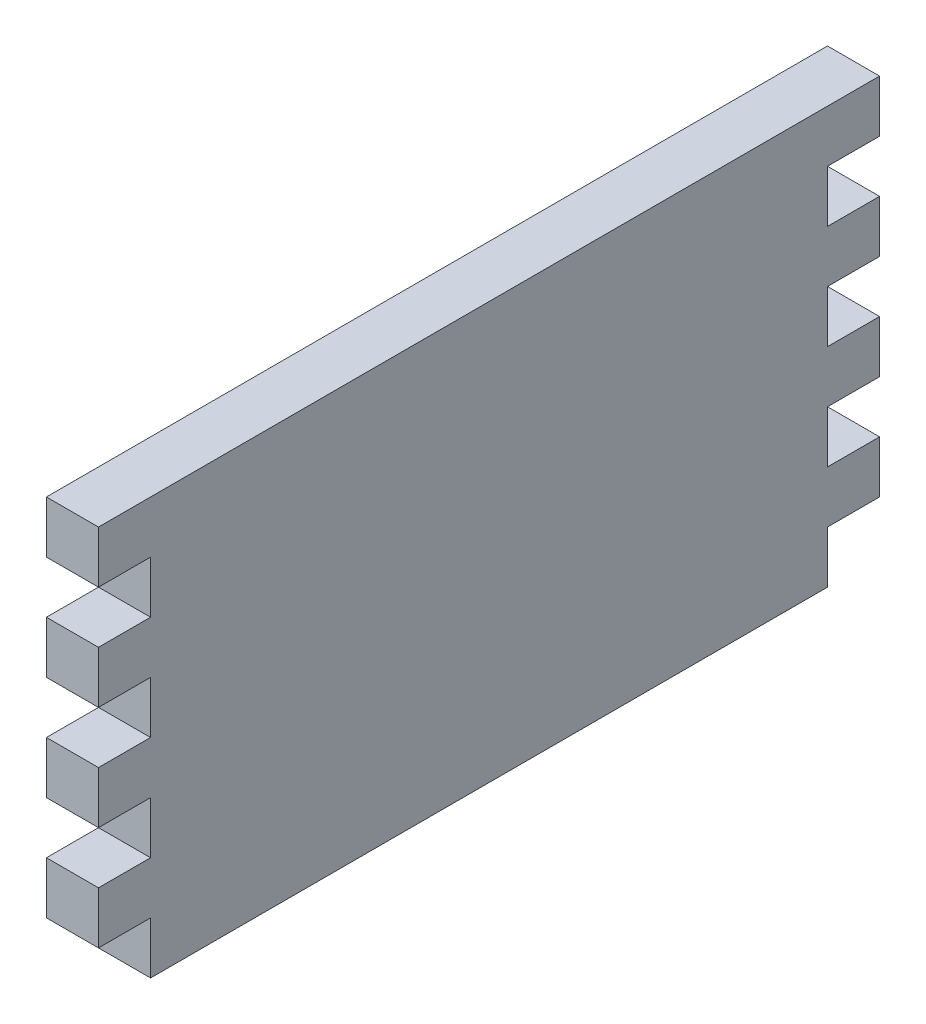
ISO-10303-21;
HEADER;
FILE_DESCRIPTION(('STEP AP214'),'2;1');
FILE_NAME('part.step','',(''),(''),'','','');
FILE_SCHEMA(('AUTOMOTIVE_DESIGN { 1 0 10303 214 1 1 1 1 }'));
ENDSEC;
DATA;
#1=APPLICATION_CONTEXT('core data for automotive mechanical design processes');
#2=APPLICATION_PROTOCOL_DEFINITION('international standard','automotive_design',2000,#1);
#3=PRODUCT_CONTEXT('',#1,'mechanical');
#4=PRODUCT('Part','Part','',(#3));
#5=PRODUCT_RELATED_PRODUCT_CATEGORY('part','',(#4));
#6=PRODUCT_DEFINITION_FORMATION('','',#4);
#7=PRODUCT_DEFINITION_CONTEXT('part definition',#1,'design');
#8=PRODUCT_DEFINITION('design','',#6,#7);
#9=PRODUCT_DEFINITION_SHAPE('','',#8);
#10=(LENGTH_UNIT() NAMED_UNIT(*) SI_UNIT(.MILLI.,.METRE.));
#11=(NAMED_UNIT(*) PLANE_ANGLE_UNIT() SI_UNIT($,.RADIAN.));
#12=(NAMED_UNIT(*) SI_UNIT($,.STERADIAN.) SOLID_ANGLE_UNIT());
#13=UNCERTAINTY_MEASURE_WITH_UNIT(LENGTH_MEASURE(1.E-05),#10,'distance_accuracy_value','');
#14=(GEOMETRIC_REPRESENTATION_CONTEXT(3) GLOBAL_UNCERTAINTY_ASSIGNED_CONTEXT((#13)) GLOBAL_UNIT_ASSIGNED_CONTEXT((#10,
#11,#12)) REPRESENTATION_CONTEXT('',''));
#15=CARTESIAN_POINT('',(0.,0.,0.));
#16=DIRECTION('',(0.,0.,1.));
#17=DIRECTION('',(1.,0.,0.));
#18=AXIS2_PLACEMENT_3D('',#15,#16,#17);
#19=CARTESIAN_POINT('',(10.,0.,150.));
#20=DIRECTION('',(0.,0.,-1.));
#21=DIRECTION('',(-1.,0.,0.));
#22=AXIS2_PLACEMENT_3D('',#19,#20,#21);
#23=PLANE('',#22);
#24=DIRECTION('',(0.,-1.,0.));
#25=VECTOR('',#24,1.);
#26=CARTESIAN_POINT('',(0.,0.,150.));
#27=LINE('',#26,#25);
#28=CARTESIAN_POINT('',(0.,20.,150.));
#29=VERTEX_POINT('',#28);
#30=CARTESIAN_POINT('',(0.,10.,150.));
#31=VERTEX_POINT('',#30);
#32=EDGE_CURVE('E259',#29,#31,#27,.T.);
#33=ORIENTED_EDGE('',*,*,#32,.T.);
#34=DIRECTION('',(-1.,0.,0.));
#35=VECTOR('',#34,1.);
#36=CARTESIAN_POINT('',(10.,10.,150.));
#37=LINE('',#36,#35);
#38=CARTESIAN_POINT('',(10.,10.,150.));
#39=VERTEX_POINT('',#38);
#40=EDGE_CURVE('E48',#39,#31,#37,.T.);
#41=ORIENTED_EDGE('',*,*,#40,.F.);
#42=DIRECTION('',(0.,-1.,0.));
#43=VECTOR('',#42,1.);
#44=CARTESIAN_POINT('',(10.,0.,150.));
#45=LINE('',#44,#43);
#46=CARTESIAN_POINT('',(10.,20.,150.));
#47=VERTEX_POINT('',#46);
#48=EDGE_CURVE('E257',#47,#39,#45,.T.);
#49=ORIENTED_EDGE('',*,*,#48,.F.);
#50=DIRECTION('',(-1.,0.,0.));
#51=VECTOR('',#50,1.);
#52=CARTESIAN_POINT('',(10.,20.,150.));
#53=LINE('',#52,#51);
#54=EDGE_CURVE('E532',#47,#29,#53,.T.);
#55=ORIENTED_EDGE('',*,*,#54,.T.);
#56=EDGE_LOOP('',(#33,#41,#49,#55));
#57=FACE_BOUND('',#56,.T.);
#58=ADVANCED_FACE('F33',(#57),#23,.F.);
#59=CARTESIAN_POINT('',(10.,0.,0.));
#60=DIRECTION('',(0.,0.,1.));
#61=DIRECTION('',(1.,0.,0.));
#62=AXIS2_PLACEMENT_3D('',#59,#60,#61);
#63=PLANE('',#62);
#64=DIRECTION('',(0.,1.,0.));
#65=VECTOR('',#64,1.);
#66=CARTESIAN_POINT('',(10.,0.,0.));
#67=LINE('',#66,#65);
#68=CARTESIAN_POINT('',(10.,30.,0.));
#69=VERTEX_POINT('',#68);
#70=CARTESIAN_POINT('',(10.,40.,0.));
#71=VERTEX_POINT('',#70);
#72=EDGE_CURVE('E386',#69,#71,#67,.T.);
#73=ORIENTED_EDGE('',*,*,#72,.F.);
#74=DIRECTION('',(-1.,0.,0.));
#75=VECTOR('',#74,1.);
#76=CARTESIAN_POINT('',(10.,30.,0.));
#77=LINE('',#76,#75);
#78=CARTESIAN_POINT('',(0.,30.,0.));
#79=VERTEX_POINT('',#78);
#80=EDGE_CURVE('E474',#69,#79,#77,.T.);
#81=ORIENTED_EDGE('',*,*,#80,.T.);
#82=DIRECTION('',(0.,1.,0.));
#83=VECTOR('',#82,1.);
#84=CARTESIAN_POINT('',(0.,0.,0.));
#85=LINE('',#84,#83);
#86=CARTESIAN_POINT('',(0.,40.,0.));
#87=VERTEX_POINT('',#86);
#88=EDGE_CURVE('E431',#79,#87,#85,.T.);
#89=ORIENTED_EDGE('',*,*,#88,.T.);
#90=DIRECTION('',(-1.,0.,0.));
#91=VECTOR('',#90,1.);
#92=CARTESIAN_POINT('',(10.,40.,0.));
#93=LINE('',#92,#91);
#94=EDGE_CURVE('E320',#71,#87,#93,.T.);
#95=ORIENTED_EDGE('',*,*,#94,.F.);
#96=EDGE_LOOP('',(#73,#81,#89,#95));
#97=FACE_BOUND('',#96,.T.);
#98=ADVANCED_FACE('F472',(#97),#63,.F.);
#99=CARTESIAN_POINT('',(0.,40.,150.));
#100=VERTEX_POINT('',#99);
#101=CARTESIAN_POINT('',(0.,30.,150.));
#102=VERTEX_POINT('',#101);
#103=EDGE_CURVE('E424',#100,#102,#27,.T.);
#104=ORIENTED_EDGE('',*,*,#103,.T.);
#105=DIRECTION('',(-1.,0.,0.));
#106=VECTOR('',#105,1.);
#107=CARTESIAN_POINT('',(10.,30.,150.));
#108=LINE('',#107,#106);
#109=CARTESIAN_POINT('',(10.,30.,150.));
#110=VERTEX_POINT('',#109);
#111=EDGE_CURVE('E538',#110,#102,#108,.T.);
#112=ORIENTED_EDGE('',*,*,#111,.F.);
#113=CARTESIAN_POINT('',(10.,40.,150.));
#114=VERTEX_POINT('',#113);
#115=EDGE_CURVE('E266',#114,#110,#45,.T.);
#116=ORIENTED_EDGE('',*,*,#115,.F.);
#117=DIRECTION('',(-1.,0.,0.));
#118=VECTOR('',#117,1.);
#119=CARTESIAN_POINT('',(10.,40.,150.));
#120=LINE('',#119,#118);
#121=EDGE_CURVE('E325',#114,#100,#120,.T.);
#122=ORIENTED_EDGE('',*,*,#121,.T.);
#123=EDGE_LOOP('',(#104,#112,#116,#122));
#124=FACE_BOUND('',#123,.T.);
#125=ADVANCED_FACE('F597',(#124),#23,.F.);
#126=CARTESIAN_POINT('',(10.,50.,0.));
#127=VERTEX_POINT('',#126);
#128=CARTESIAN_POINT('',(10.,60.,0.));
#129=VERTEX_POINT('',#128);
#130=EDGE_CURVE('E392',#127,#129,#67,.T.);
#131=ORIENTED_EDGE('',*,*,#130,.F.);
#132=DIRECTION('',(-1.,0.,0.));
#133=VECTOR('',#132,1.);
#134=CARTESIAN_POINT('',(10.,50.,0.));
#135=LINE('',#134,#133);
#136=CARTESIAN_POINT('',(0.,50.,0.));
#137=VERTEX_POINT('',#136);
#138=EDGE_CURVE('E329',#127,#137,#135,.T.);
#139=ORIENTED_EDGE('',*,*,#138,.T.);
#140=CARTESIAN_POINT('',(0.,60.,0.));
#141=VERTEX_POINT('',#140);
#142=EDGE_CURVE('E438',#137,#141,#85,.T.);
#143=ORIENTED_EDGE('',*,*,#142,.T.);
#144=DIRECTION('',(-1.,0.,0.));
#145=VECTOR('',#144,1.);
#146=CARTESIAN_POINT('',(10.,60.,0.));
#147=LINE('',#146,#145);
#148=EDGE_CURVE('E369',#129,#141,#147,.T.);
#149=ORIENTED_EDGE('',*,*,#148,.F.);
#150=EDGE_LOOP('',(#131,#139,#143,#149));
#151=FACE_BOUND('',#150,.T.);
#152=ADVANCED_FACE('F445',(#151),#63,.F.);
#153=CARTESIAN_POINT('',(0.,60.,150.));
#154=VERTEX_POINT('',#153);
#155=CARTESIAN_POINT('',(0.,50.,150.));
#156=VERTEX_POINT('',#155);
#157=EDGE_CURVE('E296',#154,#156,#27,.T.);
#158=ORIENTED_EDGE('',*,*,#157,.T.);
#159=DIRECTION('',(-1.,0.,0.));
#160=VECTOR('',#159,1.);
#161=CARTESIAN_POINT('',(10.,50.,150.));
#162=LINE('',#161,#160);
#163=CARTESIAN_POINT('',(10.,50.,150.));
#164=VERTEX_POINT('',#163);
#165=EDGE_CURVE('E295',#164,#156,#162,.T.);
#166=ORIENTED_EDGE('',*,*,#165,.F.);
#167=CARTESIAN_POINT('',(10.,60.,150.));
#168=VERTEX_POINT('',#167);
#169=EDGE_CURVE('E271',#168,#164,#45,.T.);
#170=ORIENTED_EDGE('',*,*,#169,.F.);
#171=DIRECTION('',(-1.,0.,0.));
#172=VECTOR('',#171,1.);
#173=CARTESIAN_POINT('',(10.,60.,150.));
#174=LINE('',#173,#172);
#175=EDGE_CURVE('E293',#168,#154,#174,.T.);
#176=ORIENTED_EDGE('',*,*,#175,.T.);
#177=EDGE_LOOP('',(#158,#166,#170,#176));
#178=FACE_BOUND('',#177,.T.);
#179=ADVANCED_FACE('F292',(#178),#23,.F.);
#180=CARTESIAN_POINT('',(10.,70.,0.));
#181=VERTEX_POINT('',#180);
#182=CARTESIAN_POINT('',(10.,80.,0.));
#183=VERTEX_POINT('',#182);
#184=EDGE_CURVE('E387',#181,#183,#67,.T.);
#185=ORIENTED_EDGE('',*,*,#184,.F.);
#186=DIRECTION('',(-1.,0.,0.));
#187=VECTOR('',#186,1.);
#188=CARTESIAN_POINT('',(10.,70.,0.));
#189=LINE('',#188,#187);
#190=CARTESIAN_POINT('',(0.,70.,0.));
#191=VERTEX_POINT('',#190);
#192=EDGE_CURVE('E376',#181,#191,#189,.T.);
#193=ORIENTED_EDGE('',*,*,#192,.T.);
#194=CARTESIAN_POINT('',(0.,80.,0.));
#195=VERTEX_POINT('',#194);
#196=EDGE_CURVE('E379',#191,#195,#85,.T.);
#197=ORIENTED_EDGE('',*,*,#196,.T.);
#198=DIRECTION('',(-1.,0.,0.));
#199=VECTOR('',#198,1.);
#200=CARTESIAN_POINT('',(10.,80.,0.));
#201=LINE('',#200,#199);
#202=EDGE_CURVE('E11',#183,#195,#201,.T.);
#203=ORIENTED_EDGE('',*,*,#202,.F.);
#204=EDGE_LOOP('',(#185,#193,#197,#203));
#205=FACE_BOUND('',#204,.T.);
#206=ADVANCED_FACE('F611',(#205),#63,.F.);
#207=CARTESIAN_POINT('',(10.,10.,0.));
#208=VERTEX_POINT('',#207);
#209=CARTESIAN_POINT('',(10.,20.,0.));
#210=VERTEX_POINT('',#209);
#211=EDGE_CURVE('E272',#208,#210,#67,.T.);
#212=ORIENTED_EDGE('',*,*,#211,.F.);
#213=DIRECTION('',(-1.,0.,0.));
#214=VECTOR('',#213,1.);
#215=CARTESIAN_POINT('',(10.,10.,0.));
#216=LINE('',#215,#214);
#217=CARTESIAN_POINT('',(0.,10.,0.));
#218=VERTEX_POINT('',#217);
#219=EDGE_CURVE('E521',#208,#218,#216,.T.);
#220=ORIENTED_EDGE('',*,*,#219,.T.);
#221=CARTESIAN_POINT('',(0.,20.,0.));
#222=VERTEX_POINT('',#221);
#223=EDGE_CURVE('E430',#218,#222,#85,.T.);
#224=ORIENTED_EDGE('',*,*,#223,.T.);
#225=DIRECTION('',(-1.,0.,0.));
#226=VECTOR('',#225,1.);
#227=CARTESIAN_POINT('',(10.,20.,0.));
#228=LINE('',#227,#226);
#229=EDGE_CURVE('E495',#210,#222,#228,.T.);
#230=ORIENTED_EDGE('',*,*,#229,.F.);
#231=EDGE_LOOP('',(#212,#220,#224,#230));
#232=FACE_BOUND('',#231,.T.);
#233=ADVANCED_FACE('F35',(#232),#63,.F.);
#234=CARTESIAN_POINT('',(10.,80.,0.));
#235=DIRECTION('',(0.,-1.,0.));
#236=DIRECTION('',(0.,0.,-1.));
#237=AXIS2_PLACEMENT_3D('',#234,#235,#236);
#238=PLANE('',#237);
#239=DIRECTION('',(0.,0.,1.));
#240=VECTOR('',#239,1.);
#241=CARTESIAN_POINT('',(0.,80.,0.));
#242=LINE('',#241,#240);
#243=CARTESIAN_POINT('',(0.,80.,150.));
#244=VERTEX_POINT('',#243);
#245=EDGE_CURVE('E412',#195,#244,#242,.T.);
#246=ORIENTED_EDGE('',*,*,#245,.T.);
#247=DIRECTION('',(-1.,0.,0.));
#248=VECTOR('',#247,1.);
#249=CARTESIAN_POINT('',(10.,80.,150.));
#250=LINE('',#249,#248);
#251=CARTESIAN_POINT('',(10.,80.,150.));
#252=VERTEX_POINT('',#251);
#253=EDGE_CURVE('E41',#252,#244,#250,.T.);
#254=ORIENTED_EDGE('',*,*,#253,.F.);
#255=DIRECTION('',(0.,0.,1.));
#256=VECTOR('',#255,1.);
#257=CARTESIAN_POINT('',(10.,80.,0.));
#258=LINE('',#257,#256);
#259=EDGE_CURVE('E267',#183,#252,#258,.T.);
#260=ORIENTED_EDGE('',*,*,#259,.F.);
#261=ORIENTED_EDGE('',*,*,#202,.T.);
#262=EDGE_LOOP('',(#246,#254,#260,#261));
#263=FACE_BOUND('',#262,.T.);
#264=ADVANCED_FACE('F605',(#263),#238,.F.);
#265=CARTESIAN_POINT('',(0.,70.,150.));
#266=VERTEX_POINT('',#265);
#267=EDGE_CURVE('E395',#244,#266,#27,.T.);
#268=ORIENTED_EDGE('',*,*,#267,.T.);
#269=DIRECTION('',(-1.,0.,0.));
#270=VECTOR('',#269,1.);
#271=CARTESIAN_POINT('',(10.,70.,150.));
#272=LINE('',#271,#270);
#273=CARTESIAN_POINT('',(10.,70.,150.));
#274=VERTEX_POINT('',#273);
#275=EDGE_CURVE('E345',#274,#266,#272,.T.);
#276=ORIENTED_EDGE('',*,*,#275,.F.);
#277=EDGE_CURVE('E269',#252,#274,#45,.T.);
#278=ORIENTED_EDGE('',*,*,#277,.F.);
#279=ORIENTED_EDGE('',*,*,#253,.T.);
#280=EDGE_LOOP('',(#268,#276,#278,#279));
#281=FACE_BOUND('',#280,.T.);
#282=ADVANCED_FACE('F404',(#281),#23,.F.);
#283=CARTESIAN_POINT('',(10.,0.,0.));
#284=DIRECTION('',(0.,1.,0.));
#285=DIRECTION('',(0.,0.,1.));
#286=AXIS2_PLACEMENT_3D('',#283,#284,#285);
#287=PLANE('',#286);
#288=DIRECTION('',(0.,0.,-1.));
#289=VECTOR('',#288,1.);
#290=CARTESIAN_POINT('',(10.,0.,0.));
#291=LINE('',#290,#289);
#292=CARTESIAN_POINT('',(10.,0.,140.));
#293=VERTEX_POINT('',#292);
#294=CARTESIAN_POINT('',(10.,0.,10.));
#295=VERTEX_POINT('',#294);
#296=EDGE_CURVE('E276',#293,#295,#291,.T.);
#297=ORIENTED_EDGE('',*,*,#296,.F.);
#298=DIRECTION('',(-1.,0.,0.));
#299=VECTOR('',#298,1.);
#300=CARTESIAN_POINT('',(10.,0.,140.));
#301=LINE('',#300,#299);
#302=CARTESIAN_POINT('',(0.,0.,140.));
#303=VERTEX_POINT('',#302);
#304=EDGE_CURVE('E558',#293,#303,#301,.T.);
#305=ORIENTED_EDGE('',*,*,#304,.T.);
#306=DIRECTION('',(0.,0.,-1.));
#307=VECTOR('',#306,1.);
#308=CARTESIAN_POINT('',(0.,0.,0.));
#309=LINE('',#308,#307);
#310=CARTESIAN_POINT('',(0.,0.,10.));
#311=VERTEX_POINT('',#310);
#312=EDGE_CURVE('E56',#303,#311,#309,.T.);
#313=ORIENTED_EDGE('',*,*,#312,.T.);
#314=DIRECTION('',(-1.,0.,0.));
#315=VECTOR('',#314,1.);
#316=CARTESIAN_POINT('',(10.,0.,10.));
#317=LINE('',#316,#315);
#318=EDGE_CURVE('E563',#295,#311,#317,.T.);
#319=ORIENTED_EDGE('',*,*,#318,.F.);
#320=EDGE_LOOP('',(#297,#305,#313,#319));
#321=FACE_BOUND('',#320,.T.);
#322=ADVANCED_FACE('F604',(#321),#287,.F.);
#323=CARTESIAN_POINT('',(10.,0.,0.));
#324=DIRECTION('',(1.,0.,0.));
#325=DIRECTION('',(0.,0.,-1.));
#326=AXIS2_PLACEMENT_3D('',#323,#324,#325);
#327=PLANE('',#326);
#328=DIRECTION('',(0.,-1.,0.));
#329=VECTOR('',#328,1.);
#330=CARTESIAN_POINT('',(10.,10.,140.));
#331=LINE('',#330,#329);
#332=CARTESIAN_POINT('',(10.,10.,140.));
#333=VERTEX_POINT('',#332);
#334=EDGE_CURVE('E250',#333,#293,#331,.T.);
#335=ORIENTED_EDGE('',*,*,#334,.T.);
#336=ORIENTED_EDGE('',*,*,#296,.T.);
#337=DIRECTION('',(0.,1.,0.));
#338=VECTOR('',#337,1.);
#339=CARTESIAN_POINT('',(10.,9.99999999999999,10.));
#340=LINE('',#339,#338);
#341=CARTESIAN_POINT('',(10.,9.99999999999999,10.));
#342=VERTEX_POINT('',#341);
#343=EDGE_CURVE('E553',#295,#342,#340,.T.);
#344=ORIENTED_EDGE('',*,*,#343,.T.);
#345=DIRECTION('',(0.,0.,-1.));
#346=VECTOR('',#345,1.);
#347=CARTESIAN_POINT('',(10.,10.,0.));
#348=LINE('',#347,#346);
#349=EDGE_CURVE('E556',#342,#208,#348,.T.);
#350=ORIENTED_EDGE('',*,*,#349,.T.);
#351=ORIENTED_EDGE('',*,*,#211,.T.);
#352=DIRECTION('',(0.,0.,1.));
#353=VECTOR('',#352,1.);
#354=CARTESIAN_POINT('',(10.,20.,0.));
#355=LINE('',#354,#353);
#356=CARTESIAN_POINT('',(10.,20.,10.));
#357=VERTEX_POINT('',#356);
#358=EDGE_CURVE('E482',#210,#357,#355,.T.);
#359=ORIENTED_EDGE('',*,*,#358,.T.);
#360=DIRECTION('',(0.,1.,0.));
#361=VECTOR('',#360,1.);
#362=CARTESIAN_POINT('',(10.,30.,10.));
#363=LINE('',#362,#361);
#364=CARTESIAN_POINT('',(10.,30.,10.));
#365=VERTEX_POINT('',#364);
#366=EDGE_CURVE('E484',#357,#365,#363,.T.);
#367=ORIENTED_EDGE('',*,*,#366,.T.);
#368=DIRECTION('',(0.,0.,-1.));
#369=VECTOR('',#368,1.);
#370=CARTESIAN_POINT('',(10.,30.,0.));
#371=LINE('',#370,#369);
#372=EDGE_CURVE('E497',#365,#69,#371,.T.);
#373=ORIENTED_EDGE('',*,*,#372,.T.);
#374=ORIENTED_EDGE('',*,*,#72,.T.);
#375=DIRECTION('',(0.,0.,1.));
#376=VECTOR('',#375,1.);
#377=CARTESIAN_POINT('',(10.,40.,0.));
#378=LINE('',#377,#376);
#379=CARTESIAN_POINT('',(10.,40.,10.));
#380=VERTEX_POINT('',#379);
#381=EDGE_CURVE('E310',#71,#380,#378,.T.);
#382=ORIENTED_EDGE('',*,*,#381,.T.);
#383=DIRECTION('',(0.,1.,0.));
#384=VECTOR('',#383,1.);
#385=CARTESIAN_POINT('',(10.,50.,10.));
#386=LINE('',#385,#384);
#387=CARTESIAN_POINT('',(10.,50.,10.));
#388=VERTEX_POINT('',#387);
#389=EDGE_CURVE('E313',#380,#388,#386,.T.);
#390=ORIENTED_EDGE('',*,*,#389,.T.);
#391=DIRECTION('',(0.,0.,-1.));
#392=VECTOR('',#391,1.);
#393=CARTESIAN_POINT('',(10.,50.,0.));
#394=LINE('',#393,#392);
#395=EDGE_CURVE('E317',#388,#127,#394,.T.);
#396=ORIENTED_EDGE('',*,*,#395,.T.);
#397=ORIENTED_EDGE('',*,*,#130,.T.);
#398=DIRECTION('',(0.,0.,1.));
#399=VECTOR('',#398,1.);
#400=CARTESIAN_POINT('',(10.,60.,0.));
#401=LINE('',#400,#399);
#402=CARTESIAN_POINT('',(10.,60.,10.));
#403=VERTEX_POINT('',#402);
#404=EDGE_CURVE('E359',#129,#403,#401,.T.);
#405=ORIENTED_EDGE('',*,*,#404,.T.);
#406=DIRECTION('',(0.,1.,0.));
#407=VECTOR('',#406,1.);
#408=CARTESIAN_POINT('',(10.,70.,10.));
#409=LINE('',#408,#407);
#410=CARTESIAN_POINT('',(10.,70.,10.));
#411=VERTEX_POINT('',#410);
#412=EDGE_CURVE('E362',#403,#411,#409,.T.);
#413=ORIENTED_EDGE('',*,*,#412,.T.);
#414=DIRECTION('',(0.,0.,-1.));
#415=VECTOR('',#414,1.);
#416=CARTESIAN_POINT('',(10.,70.,0.));
#417=LINE('',#416,#415);
#418=EDGE_CURVE('E366',#411,#181,#417,.T.);
#419=ORIENTED_EDGE('',*,*,#418,.T.);
#420=ORIENTED_EDGE('',*,*,#184,.T.);
#421=ORIENTED_EDGE('',*,*,#259,.T.);
#422=ORIENTED_EDGE('',*,*,#277,.T.);
#423=DIRECTION('',(0.,0.,-1.));
#424=VECTOR('',#423,1.);
#425=CARTESIAN_POINT('',(10.,70.,150.));
#426=LINE('',#425,#424);
#427=CARTESIAN_POINT('',(10.,70.,140.));
#428=VERTEX_POINT('',#427);
#429=EDGE_CURVE('E339',#274,#428,#426,.T.);
#430=ORIENTED_EDGE('',*,*,#429,.T.);
#431=DIRECTION('',(0.,-1.,0.));
#432=VECTOR('',#431,1.);
#433=CARTESIAN_POINT('',(10.,70.,140.));
#434=LINE('',#433,#432);
#435=CARTESIAN_POINT('',(10.,60.,140.));
#436=VERTEX_POINT('',#435);
#437=EDGE_CURVE('E341',#428,#436,#434,.T.);
#438=ORIENTED_EDGE('',*,*,#437,.T.);
#439=DIRECTION('',(0.,0.,1.));
#440=VECTOR('',#439,1.);
#441=CARTESIAN_POINT('',(10.,60.,150.));
#442=LINE('',#441,#440);
#443=EDGE_CURVE('E287',#436,#168,#442,.T.);
#444=ORIENTED_EDGE('',*,*,#443,.T.);
#445=ORIENTED_EDGE('',*,*,#169,.T.);
#446=DIRECTION('',(0.,0.,-1.));
#447=VECTOR('',#446,1.);
#448=CARTESIAN_POINT('',(10.,50.,150.));
#449=LINE('',#448,#447);
#450=CARTESIAN_POINT('',(10.,50.,140.));
#451=VERTEX_POINT('',#450);
#452=EDGE_CURVE('E284',#164,#451,#449,.T.);
#453=ORIENTED_EDGE('',*,*,#452,.T.);
#454=DIRECTION('',(0.,-1.,0.));
#455=VECTOR('',#454,1.);
#456=CARTESIAN_POINT('',(10.,50.,140.));
#457=LINE('',#456,#455);
#458=CARTESIAN_POINT('',(10.,40.,140.));
#459=VERTEX_POINT('',#458);
#460=EDGE_CURVE('E306',#451,#459,#457,.T.);
#461=ORIENTED_EDGE('',*,*,#460,.T.);
#462=DIRECTION('',(0.,0.,1.));
#463=VECTOR('',#462,1.);
#464=CARTESIAN_POINT('',(10.,40.,150.));
#465=LINE('',#464,#463);
#466=EDGE_CURVE('E301',#459,#114,#465,.T.);
#467=ORIENTED_EDGE('',*,*,#466,.T.);
#468=ORIENTED_EDGE('',*,*,#115,.T.);
#469=DIRECTION('',(0.,0.,-1.));
#470=VECTOR('',#469,1.);
#471=CARTESIAN_POINT('',(10.,30.,150.));
#472=LINE('',#471,#470);
#473=CARTESIAN_POINT('',(10.,30.,140.));
#474=VERTEX_POINT('',#473);
#475=EDGE_CURVE('E531',#110,#474,#472,.T.);
#476=ORIENTED_EDGE('',*,*,#475,.T.);
#477=DIRECTION('',(0.,-1.,0.));
#478=VECTOR('',#477,1.);
#479=CARTESIAN_POINT('',(10.,30.,140.));
#480=LINE('',#479,#478);
#481=CARTESIAN_POINT('',(10.,20.,140.));
#482=VERTEX_POINT('',#481);
#483=EDGE_CURVE('E566',#474,#482,#480,.T.);
#484=ORIENTED_EDGE('',*,*,#483,.T.);
#485=DIRECTION('',(0.,0.,1.));
#486=VECTOR('',#485,1.);
#487=CARTESIAN_POINT('',(10.,20.,150.));
#488=LINE('',#487,#486);
#489=EDGE_CURVE('E265',#482,#47,#488,.T.);
#490=ORIENTED_EDGE('',*,*,#489,.T.);
#491=ORIENTED_EDGE('',*,*,#48,.T.);
#492=DIRECTION('',(0.,0.,-1.));
#493=VECTOR('',#492,1.);
#494=CARTESIAN_POINT('',(10.,10.,150.));
#495=LINE('',#494,#493);
#496=EDGE_CURVE('E243',#39,#333,#495,.T.);
#497=ORIENTED_EDGE('',*,*,#496,.T.);
#498=EDGE_LOOP('',(#335,#336,#344,#350,#351,#359,#367,#373,#374,#382,#390,#396,#397,#405,#413,
#419,#420,#421,#422,#430,#438,#444,#445,#453,#461,#467,#468,#476,#484,#490,#491,#497));
#499=FACE_BOUND('',#498,.T.);
#500=ADVANCED_FACE('F262',(#499),#327,.T.);
#501=CARTESIAN_POINT('',(0.,0.,0.));
#502=DIRECTION('',(1.,0.,0.));
#503=DIRECTION('',(0.,0.,-1.));
#504=AXIS2_PLACEMENT_3D('',#501,#502,#503);
#505=PLANE('',#504);
#506=ORIENTED_EDGE('',*,*,#312,.F.);
#507=DIRECTION('',(0.,-1.,0.));
#508=VECTOR('',#507,1.);
#509=CARTESIAN_POINT('',(0.,10.,140.));
#510=LINE('',#509,#508);
#511=CARTESIAN_POINT('',(0.,10.,140.));
#512=VERTEX_POINT('',#511);
#513=EDGE_CURVE('E251',#512,#303,#510,.T.);
#514=ORIENTED_EDGE('',*,*,#513,.F.);
#515=DIRECTION('',(0.,0.,-1.));
#516=VECTOR('',#515,1.);
#517=CARTESIAN_POINT('',(0.,10.,150.));
#518=LINE('',#517,#516);
#519=EDGE_CURVE('E573',#31,#512,#518,.T.);
#520=ORIENTED_EDGE('',*,*,#519,.F.);
#521=ORIENTED_EDGE('',*,*,#32,.F.);
#522=DIRECTION('',(0.,0.,1.));
#523=VECTOR('',#522,1.);
#524=CARTESIAN_POINT('',(0.,20.,150.));
#525=LINE('',#524,#523);
#526=CARTESIAN_POINT('',(0.,20.,140.));
#527=VERTEX_POINT('',#526);
#528=EDGE_CURVE('E523',#527,#29,#525,.T.);
#529=ORIENTED_EDGE('',*,*,#528,.F.);
#530=DIRECTION('',(0.,-1.,0.));
#531=VECTOR('',#530,1.);
#532=CARTESIAN_POINT('',(0.,30.,140.));
#533=LINE('',#532,#531);
#534=CARTESIAN_POINT('',(0.,30.,140.));
#535=VERTEX_POINT('',#534);
#536=EDGE_CURVE('E519',#535,#527,#533,.T.);
#537=ORIENTED_EDGE('',*,*,#536,.F.);
#538=DIRECTION('',(0.,0.,-1.));
#539=VECTOR('',#538,1.);
#540=CARTESIAN_POINT('',(0.,30.,150.));
#541=LINE('',#540,#539);
#542=EDGE_CURVE('E516',#102,#535,#541,.T.);
#543=ORIENTED_EDGE('',*,*,#542,.F.);
#544=ORIENTED_EDGE('',*,*,#103,.F.);
#545=DIRECTION('',(0.,0.,1.));
#546=VECTOR('',#545,1.);
#547=CARTESIAN_POINT('',(0.,40.,150.));
#548=LINE('',#547,#546);
#549=CARTESIAN_POINT('',(0.,40.,140.));
#550=VERTEX_POINT('',#549);
#551=EDGE_CURVE('E499',#550,#100,#548,.T.);
#552=ORIENTED_EDGE('',*,*,#551,.F.);
#553=DIRECTION('',(0.,-1.,0.));
#554=VECTOR('',#553,1.);
#555=CARTESIAN_POINT('',(0.,50.,140.));
#556=LINE('',#555,#554);
#557=CARTESIAN_POINT('',(0.,50.,140.));
#558=VERTEX_POINT('',#557);
#559=EDGE_CURVE('E502',#558,#550,#556,.T.);
#560=ORIENTED_EDGE('',*,*,#559,.F.);
#561=DIRECTION('',(0.,0.,-1.));
#562=VECTOR('',#561,1.);
#563=CARTESIAN_POINT('',(0.,50.,150.));
#564=LINE('',#563,#562);
#565=EDGE_CURVE('E423',#156,#558,#564,.T.);
#566=ORIENTED_EDGE('',*,*,#565,.F.);
#567=ORIENTED_EDGE('',*,*,#157,.F.);
#568=DIRECTION('',(0.,0.,1.));
#569=VECTOR('',#568,1.);
#570=CARTESIAN_POINT('',(0.,60.,150.));
#571=LINE('',#570,#569);
#572=CARTESIAN_POINT('',(0.,60.,140.));
#573=VERTEX_POINT('',#572);
#574=EDGE_CURVE('E342',#573,#154,#571,.T.);
#575=ORIENTED_EDGE('',*,*,#574,.F.);
#576=DIRECTION('',(0.,-1.,0.));
#577=VECTOR('',#576,1.);
#578=CARTESIAN_POINT('',(0.,70.,140.));
#579=LINE('',#578,#577);
#580=CARTESIAN_POINT('',(0.,70.,140.));
#581=VERTEX_POINT('',#580);
#582=EDGE_CURVE('E348',#581,#573,#579,.T.);
#583=ORIENTED_EDGE('',*,*,#582,.F.);
#584=DIRECTION('',(0.,0.,-1.));
#585=VECTOR('',#584,1.);
#586=CARTESIAN_POINT('',(0.,70.,150.));
#587=LINE('',#586,#585);
#588=EDGE_CURVE('E332',#266,#581,#587,.T.);
#589=ORIENTED_EDGE('',*,*,#588,.F.);
#590=ORIENTED_EDGE('',*,*,#267,.F.);
#591=ORIENTED_EDGE('',*,*,#245,.F.);
#592=ORIENTED_EDGE('',*,*,#196,.F.);
#593=DIRECTION('',(0.,0.,-1.));
#594=VECTOR('',#593,1.);
#595=CARTESIAN_POINT('',(0.,70.,0.));
#596=LINE('',#595,#594);
#597=CARTESIAN_POINT('',(0.,70.,10.));
#598=VERTEX_POINT('',#597);
#599=EDGE_CURVE('E363',#598,#191,#596,.T.);
#600=ORIENTED_EDGE('',*,*,#599,.F.);
#601=DIRECTION('',(0.,1.,0.));
#602=VECTOR('',#601,1.);
#603=CARTESIAN_POINT('',(0.,70.,10.));
#604=LINE('',#603,#602);
#605=CARTESIAN_POINT('',(0.,60.,10.));
#606=VERTEX_POINT('',#605);
#607=EDGE_CURVE('E372',#606,#598,#604,.T.);
#608=ORIENTED_EDGE('',*,*,#607,.F.);
#609=DIRECTION('',(0.,0.,1.));
#610=VECTOR('',#609,1.);
#611=CARTESIAN_POINT('',(0.,60.,0.));
#612=LINE('',#611,#610);
#613=EDGE_CURVE('E353',#141,#606,#612,.T.);
#614=ORIENTED_EDGE('',*,*,#613,.F.);
#615=ORIENTED_EDGE('',*,*,#142,.F.);
#616=DIRECTION('',(0.,0.,-1.));
#617=VECTOR('',#616,1.);
#618=CARTESIAN_POINT('',(0.,50.,0.));
#619=LINE('',#618,#617);
#620=CARTESIAN_POINT('',(0.,50.,10.));
#621=VERTEX_POINT('',#620);
#622=EDGE_CURVE('E314',#621,#137,#619,.T.);
#623=ORIENTED_EDGE('',*,*,#622,.F.);
#624=DIRECTION('',(0.,1.,0.));
#625=VECTOR('',#624,1.);
#626=CARTESIAN_POINT('',(0.,50.,10.));
#627=LINE('',#626,#625);
#628=CARTESIAN_POINT('',(0.,40.,10.));
#629=VERTEX_POINT('',#628);
#630=EDGE_CURVE('E324',#629,#621,#627,.T.);
#631=ORIENTED_EDGE('',*,*,#630,.F.);
#632=DIRECTION('',(0.,0.,1.));
#633=VECTOR('',#632,1.);
#634=CARTESIAN_POINT('',(0.,40.,0.));
#635=LINE('',#634,#633);
#636=EDGE_CURVE('E321',#87,#629,#635,.T.);
#637=ORIENTED_EDGE('',*,*,#636,.F.);
#638=ORIENTED_EDGE('',*,*,#88,.F.);
#639=DIRECTION('',(0.,0.,-1.));
#640=VECTOR('',#639,1.);
#641=CARTESIAN_POINT('',(0.,30.,0.));
#642=LINE('',#641,#640);
#643=CARTESIAN_POINT('',(0.,30.,10.));
#644=VERTEX_POINT('',#643);
#645=EDGE_CURVE('E477',#644,#79,#642,.T.);
#646=ORIENTED_EDGE('',*,*,#645,.F.);
#647=DIRECTION('',(0.,1.,0.));
#648=VECTOR('',#647,1.);
#649=CARTESIAN_POINT('',(0.,30.,10.));
#650=LINE('',#649,#648);
#651=CARTESIAN_POINT('',(0.,20.,10.));
#652=VERTEX_POINT('',#651);
#653=EDGE_CURVE('E480',#652,#644,#650,.T.);
#654=ORIENTED_EDGE('',*,*,#653,.F.);
#655=DIRECTION('',(0.,0.,1.));
#656=VECTOR('',#655,1.);
#657=CARTESIAN_POINT('',(0.,20.,0.));
#658=LINE('',#657,#656);
#659=EDGE_CURVE('E486',#222,#652,#658,.T.);
#660=ORIENTED_EDGE('',*,*,#659,.F.);
#661=ORIENTED_EDGE('',*,*,#223,.F.);
#662=DIRECTION('',(0.,0.,-1.));
#663=VECTOR('',#662,1.);
#664=CARTESIAN_POINT('',(0.,10.,0.));
#665=LINE('',#664,#663);
#666=CARTESIAN_POINT('',(0.,9.99999999999999,10.));
#667=VERTEX_POINT('',#666);
#668=EDGE_CURVE('E549',#667,#218,#665,.T.);
#669=ORIENTED_EDGE('',*,*,#668,.F.);
#670=DIRECTION('',(0.,1.,0.));
#671=VECTOR('',#670,1.);
#672=CARTESIAN_POINT('',(0.,9.99999999999999,10.));
#673=LINE('',#672,#671);
#674=EDGE_CURVE('E551',#311,#667,#673,.T.);
#675=ORIENTED_EDGE('',*,*,#674,.F.);
#676=EDGE_LOOP('',(#506,#514,#520,#521,#529,#537,#543,#544,#552,#560,#566,#567,#575,#583,#589,
#590,#591,#592,#600,#608,#614,#615,#623,#631,#637,#638,#646,#654,#660,#661,#669,#675));
#677=FACE_BOUND('',#676,.T.);
#678=ADVANCED_FACE('F410',(#677),#505,.F.);
#679=CARTESIAN_POINT('',(10.,70.,0.));
#680=DIRECTION('',(0.,1.,0.));
#681=DIRECTION('',(0.,0.,1.));
#682=AXIS2_PLACEMENT_3D('',#679,#680,#681);
#683=PLANE('',#682);
#684=ORIENTED_EDGE('',*,*,#599,.T.);
#685=ORIENTED_EDGE('',*,*,#192,.F.);
#686=ORIENTED_EDGE('',*,*,#418,.F.);
#687=DIRECTION('',(-1.,0.,0.));
#688=VECTOR('',#687,1.);
#689=CARTESIAN_POINT('',(10.,70.,10.));
#690=LINE('',#689,#688);
#691=EDGE_CURVE('E380',#411,#598,#690,.T.);
#692=ORIENTED_EDGE('',*,*,#691,.T.);
#693=EDGE_LOOP('',(#684,#685,#686,#692));
#694=FACE_BOUND('',#693,.T.);
#695=ADVANCED_FACE('F673',(#694),#683,.F.);
#696=CARTESIAN_POINT('',(10.,70.,10.));
#697=DIRECTION('',(0.,0.,1.));
#698=DIRECTION('',(0.,-1.,0.));
#699=AXIS2_PLACEMENT_3D('',#696,#697,#698);
#700=PLANE('',#699);
#701=ORIENTED_EDGE('',*,*,#607,.T.);
#702=ORIENTED_EDGE('',*,*,#691,.F.);
#703=ORIENTED_EDGE('',*,*,#412,.F.);
#704=DIRECTION('',(-1.,0.,0.));
#705=VECTOR('',#704,1.);
#706=CARTESIAN_POINT('',(10.,60.,10.));
#707=LINE('',#706,#705);
#708=EDGE_CURVE('E382',#403,#606,#707,.T.);
#709=ORIENTED_EDGE('',*,*,#708,.T.);
#710=EDGE_LOOP('',(#701,#702,#703,#709));
#711=FACE_BOUND('',#710,.T.);
#712=ADVANCED_FACE('F454',(#711),#700,.F.);
#713=CARTESIAN_POINT('',(10.,60.,0.));
#714=DIRECTION('',(0.,-1.,0.));
#715=DIRECTION('',(0.,0.,-1.));
#716=AXIS2_PLACEMENT_3D('',#713,#714,#715);
#717=PLANE('',#716);
#718=ORIENTED_EDGE('',*,*,#613,.T.);
#719=ORIENTED_EDGE('',*,*,#708,.F.);
#720=ORIENTED_EDGE('',*,*,#404,.F.);
#721=ORIENTED_EDGE('',*,*,#148,.T.);
#722=EDGE_LOOP('',(#718,#719,#720,#721));
#723=FACE_BOUND('',#722,.T.);
#724=ADVANCED_FACE('F450',(#723),#717,.F.);
#725=CARTESIAN_POINT('',(10.,60.,150.));
#726=DIRECTION('',(0.,-1.,0.));
#727=DIRECTION('',(0.,0.,-1.));
#728=AXIS2_PLACEMENT_3D('',#725,#726,#727);
#729=PLANE('',#728);
#730=ORIENTED_EDGE('',*,*,#574,.T.);
#731=ORIENTED_EDGE('',*,*,#175,.F.);
#732=ORIENTED_EDGE('',*,*,#443,.F.);
#733=DIRECTION('',(-1.,0.,0.));
#734=VECTOR('',#733,1.);
#735=CARTESIAN_POINT('',(10.,60.,140.));
#736=LINE('',#735,#734);
#737=EDGE_CURVE('E354',#436,#573,#736,.T.);
#738=ORIENTED_EDGE('',*,*,#737,.T.);
#739=EDGE_LOOP('',(#730,#731,#732,#738));
#740=FACE_BOUND('',#739,.T.);
#741=ADVANCED_FACE('F421',(#740),#729,.F.);
#742=CARTESIAN_POINT('',(10.,70.,140.));
#743=DIRECTION('',(0.,0.,-1.));
#744=DIRECTION('',(0.,1.,0.));
#745=AXIS2_PLACEMENT_3D('',#742,#743,#744);
#746=PLANE('',#745);
#747=ORIENTED_EDGE('',*,*,#582,.T.);
#748=ORIENTED_EDGE('',*,*,#737,.F.);
#749=ORIENTED_EDGE('',*,*,#437,.F.);
#750=DIRECTION('',(-1.,0.,0.));
#751=VECTOR('',#750,1.);
#752=CARTESIAN_POINT('',(10.,70.,140.));
#753=LINE('',#752,#751);
#754=EDGE_CURVE('E356',#428,#581,#753,.T.);
#755=ORIENTED_EDGE('',*,*,#754,.T.);
#756=EDGE_LOOP('',(#747,#748,#749,#755));
#757=FACE_BOUND('',#756,.T.);
#758=ADVANCED_FACE('F419',(#757),#746,.F.);
#759=CARTESIAN_POINT('',(10.,70.,150.));
#760=DIRECTION('',(0.,1.,0.));
#761=DIRECTION('',(0.,0.,1.));
#762=AXIS2_PLACEMENT_3D('',#759,#760,#761);
#763=PLANE('',#762);
#764=ORIENTED_EDGE('',*,*,#588,.T.);
#765=ORIENTED_EDGE('',*,*,#754,.F.);
#766=ORIENTED_EDGE('',*,*,#429,.F.);
#767=ORIENTED_EDGE('',*,*,#275,.T.);
#768=EDGE_LOOP('',(#764,#765,#766,#767));
#769=FACE_BOUND('',#768,.T.);
#770=ADVANCED_FACE('F416',(#769),#763,.F.);
#771=CARTESIAN_POINT('',(10.,50.,0.));
#772=DIRECTION('',(0.,1.,0.));
#773=DIRECTION('',(0.,0.,1.));
#774=AXIS2_PLACEMENT_3D('',#771,#772,#773);
#775=PLANE('',#774);
#776=ORIENTED_EDGE('',*,*,#622,.T.);
#777=ORIENTED_EDGE('',*,*,#138,.F.);
#778=ORIENTED_EDGE('',*,*,#395,.F.);
#779=DIRECTION('',(-1.,0.,0.));
#780=VECTOR('',#779,1.);
#781=CARTESIAN_POINT('',(10.,50.,10.));
#782=LINE('',#781,#780);
#783=EDGE_CURVE('E333',#388,#621,#782,.T.);
#784=ORIENTED_EDGE('',*,*,#783,.T.);
#785=EDGE_LOOP('',(#776,#777,#778,#784));
#786=FACE_BOUND('',#785,.T.);
#787=ADVANCED_FACE('F460',(#786),#775,.F.);
#788=CARTESIAN_POINT('',(10.,50.,10.));
#789=DIRECTION('',(0.,0.,1.));
#790=DIRECTION('',(0.,-1.,0.));
#791=AXIS2_PLACEMENT_3D('',#788,#789,#790);
#792=PLANE('',#791);
#793=ORIENTED_EDGE('',*,*,#630,.T.);
#794=ORIENTED_EDGE('',*,*,#783,.F.);
#795=ORIENTED_EDGE('',*,*,#389,.F.);
#796=DIRECTION('',(-1.,0.,0.));
#797=VECTOR('',#796,1.);
#798=CARTESIAN_POINT('',(10.,40.,10.));
#799=LINE('',#798,#797);
#800=EDGE_CURVE('E335',#380,#629,#799,.T.);
#801=ORIENTED_EDGE('',*,*,#800,.T.);
#802=EDGE_LOOP('',(#793,#794,#795,#801));
#803=FACE_BOUND('',#802,.T.);
#804=ADVANCED_FACE('F465',(#803),#792,.F.);
#805=CARTESIAN_POINT('',(10.,40.,0.));
#806=DIRECTION('',(0.,-1.,0.));
#807=DIRECTION('',(0.,0.,-1.));
#808=AXIS2_PLACEMENT_3D('',#805,#806,#807);
#809=PLANE('',#808);
#810=ORIENTED_EDGE('',*,*,#636,.T.);
#811=ORIENTED_EDGE('',*,*,#800,.F.);
#812=ORIENTED_EDGE('',*,*,#381,.F.);
#813=ORIENTED_EDGE('',*,*,#94,.T.);
#814=EDGE_LOOP('',(#810,#811,#812,#813));
#815=FACE_BOUND('',#814,.T.);
#816=ADVANCED_FACE('F468',(#815),#809,.F.);
#817=CARTESIAN_POINT('',(10.,40.,150.));
#818=DIRECTION('',(0.,-1.,0.));
#819=DIRECTION('',(0.,0.,-1.));
#820=AXIS2_PLACEMENT_3D('',#817,#818,#819);
#821=PLANE('',#820);
#822=ORIENTED_EDGE('',*,*,#551,.T.);
#823=ORIENTED_EDGE('',*,*,#121,.F.);
#824=ORIENTED_EDGE('',*,*,#466,.F.);
#825=DIRECTION('',(-1.,0.,0.));
#826=VECTOR('',#825,1.);
#827=CARTESIAN_POINT('',(10.,40.,140.));
#828=LINE('',#827,#826);
#829=EDGE_CURVE('E303',#459,#550,#828,.T.);
#830=ORIENTED_EDGE('',*,*,#829,.T.);
#831=EDGE_LOOP('',(#822,#823,#824,#830));
#832=FACE_BOUND('',#831,.T.);
#833=ADVANCED_FACE('F508',(#832),#821,.F.);
#834=CARTESIAN_POINT('',(10.,50.,140.));
#835=DIRECTION('',(0.,0.,-1.));
#836=DIRECTION('',(0.,1.,0.));
#837=AXIS2_PLACEMENT_3D('',#834,#835,#836);
#838=PLANE('',#837);
#839=ORIENTED_EDGE('',*,*,#559,.T.);
#840=ORIENTED_EDGE('',*,*,#829,.F.);
#841=ORIENTED_EDGE('',*,*,#460,.F.);
#842=DIRECTION('',(-1.,0.,0.));
#843=VECTOR('',#842,1.);
#844=CARTESIAN_POINT('',(10.,50.,140.));
#845=LINE('',#844,#843);
#846=EDGE_CURVE('E300',#451,#558,#845,.T.);
#847=ORIENTED_EDGE('',*,*,#846,.T.);
#848=EDGE_LOOP('',(#839,#840,#841,#847));
#849=FACE_BOUND('',#848,.T.);
#850=ADVANCED_FACE('F512',(#849),#838,.F.);
#851=CARTESIAN_POINT('',(10.,50.,150.));
#852=DIRECTION('',(0.,1.,0.));
#853=DIRECTION('',(0.,0.,1.));
#854=AXIS2_PLACEMENT_3D('',#851,#852,#853);
#855=PLANE('',#854);
#856=ORIENTED_EDGE('',*,*,#565,.T.);
#857=ORIENTED_EDGE('',*,*,#846,.F.);
#858=ORIENTED_EDGE('',*,*,#452,.F.);
#859=ORIENTED_EDGE('',*,*,#165,.T.);
#860=EDGE_LOOP('',(#856,#857,#858,#859));
#861=FACE_BOUND('',#860,.T.);
#862=ADVANCED_FACE('F768',(#861),#855,.F.);
#863=CARTESIAN_POINT('',(10.,30.,0.));
#864=DIRECTION('',(0.,1.,0.));
#865=DIRECTION('',(0.,0.,1.));
#866=AXIS2_PLACEMENT_3D('',#863,#864,#865);
#867=PLANE('',#866);
#868=ORIENTED_EDGE('',*,*,#645,.T.);
#869=ORIENTED_EDGE('',*,*,#80,.F.);
#870=ORIENTED_EDGE('',*,*,#372,.F.);
#871=DIRECTION('',(-1.,0.,0.));
#872=VECTOR('',#871,1.);
#873=CARTESIAN_POINT('',(10.,30.,10.));
#874=LINE('',#873,#872);
#875=EDGE_CURVE('E491',#365,#644,#874,.T.);
#876=ORIENTED_EDGE('',*,*,#875,.T.);
#877=EDGE_LOOP('',(#868,#869,#870,#876));
#878=FACE_BOUND('',#877,.T.);
#879=ADVANCED_FACE('F777',(#878),#867,.F.);
#880=CARTESIAN_POINT('',(10.,30.,10.));
#881=DIRECTION('',(0.,0.,1.));
#882=DIRECTION('',(0.,-1.,0.));
#883=AXIS2_PLACEMENT_3D('',#880,#881,#882);
#884=PLANE('',#883);
#885=ORIENTED_EDGE('',*,*,#653,.T.);
#886=ORIENTED_EDGE('',*,*,#875,.F.);
#887=ORIENTED_EDGE('',*,*,#366,.F.);
#888=DIRECTION('',(-1.,0.,0.));
#889=VECTOR('',#888,1.);
#890=CARTESIAN_POINT('',(10.,20.,10.));
#891=LINE('',#890,#889);
#892=EDGE_CURVE('E493',#357,#652,#891,.T.);
#893=ORIENTED_EDGE('',*,*,#892,.T.);
#894=EDGE_LOOP('',(#885,#886,#887,#893));
#895=FACE_BOUND('',#894,.T.);
#896=ADVANCED_FACE('F786',(#895),#884,.F.);
#897=CARTESIAN_POINT('',(10.,20.,0.));
#898=DIRECTION('',(0.,-1.,0.));
#899=DIRECTION('',(0.,0.,-1.));
#900=AXIS2_PLACEMENT_3D('',#897,#898,#899);
#901=PLANE('',#900);
#902=ORIENTED_EDGE('',*,*,#659,.T.);
#903=ORIENTED_EDGE('',*,*,#892,.F.);
#904=ORIENTED_EDGE('',*,*,#358,.F.);
#905=ORIENTED_EDGE('',*,*,#229,.T.);
#906=EDGE_LOOP('',(#902,#903,#904,#905));
#907=FACE_BOUND('',#906,.T.);
#908=ADVANCED_FACE('F545',(#907),#901,.F.);
#909=CARTESIAN_POINT('',(10.,20.,150.));
#910=DIRECTION('',(0.,-1.,0.));
#911=DIRECTION('',(0.,0.,-1.));
#912=AXIS2_PLACEMENT_3D('',#909,#910,#911);
#913=PLANE('',#912);
#914=ORIENTED_EDGE('',*,*,#528,.T.);
#915=ORIENTED_EDGE('',*,*,#54,.F.);
#916=ORIENTED_EDGE('',*,*,#489,.F.);
#917=DIRECTION('',(-1.,0.,0.));
#918=VECTOR('',#917,1.);
#919=CARTESIAN_POINT('',(10.,20.,140.));
#920=LINE('',#919,#918);
#921=EDGE_CURVE('E534',#482,#527,#920,.T.);
#922=ORIENTED_EDGE('',*,*,#921,.T.);
#923=EDGE_LOOP('',(#914,#915,#916,#922));
#924=FACE_BOUND('',#923,.T.);
#925=ADVANCED_FACE('F571',(#924),#913,.F.);
#926=CARTESIAN_POINT('',(10.,30.,140.));
#927=DIRECTION('',(0.,0.,-1.));
#928=DIRECTION('',(0.,1.,0.));
#929=AXIS2_PLACEMENT_3D('',#926,#927,#928);
#930=PLANE('',#929);
#931=ORIENTED_EDGE('',*,*,#536,.T.);
#932=ORIENTED_EDGE('',*,*,#921,.F.);
#933=ORIENTED_EDGE('',*,*,#483,.F.);
#934=DIRECTION('',(-1.,0.,0.));
#935=VECTOR('',#934,1.);
#936=CARTESIAN_POINT('',(10.,30.,140.));
#937=LINE('',#936,#935);
#938=EDGE_CURVE('E536',#474,#535,#937,.T.);
#939=ORIENTED_EDGE('',*,*,#938,.T.);
#940=EDGE_LOOP('',(#931,#932,#933,#939));
#941=FACE_BOUND('',#940,.T.);
#942=ADVANCED_FACE('F569',(#941),#930,.F.);
#943=CARTESIAN_POINT('',(10.,30.,150.));
#944=DIRECTION('',(0.,1.,0.));
#945=DIRECTION('',(0.,0.,1.));
#946=AXIS2_PLACEMENT_3D('',#943,#944,#945);
#947=PLANE('',#946);
#948=ORIENTED_EDGE('',*,*,#542,.T.);
#949=ORIENTED_EDGE('',*,*,#938,.F.);
#950=ORIENTED_EDGE('',*,*,#475,.F.);
#951=ORIENTED_EDGE('',*,*,#111,.T.);
#952=EDGE_LOOP('',(#948,#949,#950,#951));
#953=FACE_BOUND('',#952,.T.);
#954=ADVANCED_FACE('F584',(#953),#947,.F.);
#955=CARTESIAN_POINT('',(10.,10.,0.));
#956=DIRECTION('',(0.,1.,0.));
#957=DIRECTION('',(0.,0.,1.));
#958=AXIS2_PLACEMENT_3D('',#955,#956,#957);
#959=PLANE('',#958);
#960=ORIENTED_EDGE('',*,*,#668,.T.);
#961=ORIENTED_EDGE('',*,*,#219,.F.);
#962=ORIENTED_EDGE('',*,*,#349,.F.);
#963=DIRECTION('',(-1.,0.,0.));
#964=VECTOR('',#963,1.);
#965=CARTESIAN_POINT('',(10.,9.99999999999999,10.));
#966=LINE('',#965,#964);
#967=EDGE_CURVE('E525',#342,#667,#966,.T.);
#968=ORIENTED_EDGE('',*,*,#967,.T.);
#969=EDGE_LOOP('',(#960,#961,#962,#968));
#970=FACE_BOUND('',#969,.T.);
#971=ADVANCED_FACE('F581',(#970),#959,.F.);
#972=CARTESIAN_POINT('',(10.,9.99999999999999,10.));
#973=DIRECTION('',(0.,0.,1.));
#974=DIRECTION('',(0.,-1.,0.));
#975=AXIS2_PLACEMENT_3D('',#972,#973,#974);
#976=PLANE('',#975);
#977=ORIENTED_EDGE('',*,*,#674,.T.);
#978=ORIENTED_EDGE('',*,*,#967,.F.);
#979=ORIENTED_EDGE('',*,*,#343,.F.);
#980=ORIENTED_EDGE('',*,*,#318,.T.);
#981=EDGE_LOOP('',(#977,#978,#979,#980));
#982=FACE_BOUND('',#981,.T.);
#983=ADVANCED_FACE('F583',(#982),#976,.F.);
#984=CARTESIAN_POINT('',(10.,10.,140.));
#985=DIRECTION('',(0.,0.,-1.));
#986=DIRECTION('',(0.,1.,0.));
#987=AXIS2_PLACEMENT_3D('',#984,#985,#986);
#988=PLANE('',#987);
#989=ORIENTED_EDGE('',*,*,#513,.T.);
#990=ORIENTED_EDGE('',*,*,#304,.F.);
#991=ORIENTED_EDGE('',*,*,#334,.F.);
#992=DIRECTION('',(-1.,0.,0.));
#993=VECTOR('',#992,1.);
#994=CARTESIAN_POINT('',(10.,10.,140.));
#995=LINE('',#994,#993);
#996=EDGE_CURVE('E245',#333,#512,#995,.T.);
#997=ORIENTED_EDGE('',*,*,#996,.T.);
#998=EDGE_LOOP('',(#989,#990,#991,#997));
#999=FACE_BOUND('',#998,.T.);
#1000=ADVANCED_FACE('F590',(#999),#988,.F.);
#1001=CARTESIAN_POINT('',(10.,10.,150.));
#1002=DIRECTION('',(0.,1.,0.));
#1003=DIRECTION('',(0.,0.,1.));
#1004=AXIS2_PLACEMENT_3D('',#1001,#1002,#1003);
#1005=PLANE('',#1004);
#1006=ORIENTED_EDGE('',*,*,#519,.T.);
#1007=ORIENTED_EDGE('',*,*,#996,.F.);
#1008=ORIENTED_EDGE('',*,*,#496,.F.);
#1009=ORIENTED_EDGE('',*,*,#40,.T.);
#1010=EDGE_LOOP('',(#1006,#1007,#1008,#1009));
#1011=FACE_BOUND('',#1010,.T.);
#1012=ADVANCED_FACE('F244',(#1011),#1005,.F.);
#1013=CLOSED_SHELL('',(#58,#98,#125,#152,#179,#206,#233,#264,#282,#322,#500,#678,#695,#712,#724,
#741,#758,#770,#787,#804,#816,#833,#850,#862,#879,#896,#908,#925,#942,#954,#971,#983,#1000,#1012));
#1014=MANIFOLD_SOLID_BREP('B2',#1013);
#1015=ADVANCED_BREP_SHAPE_REPRESENTATION('',(#18,#1014),#14);
#1016=SHAPE_DEFINITION_REPRESENTATION(#9,#1015);
ENDSEC;
END-ISO-10303-21;
